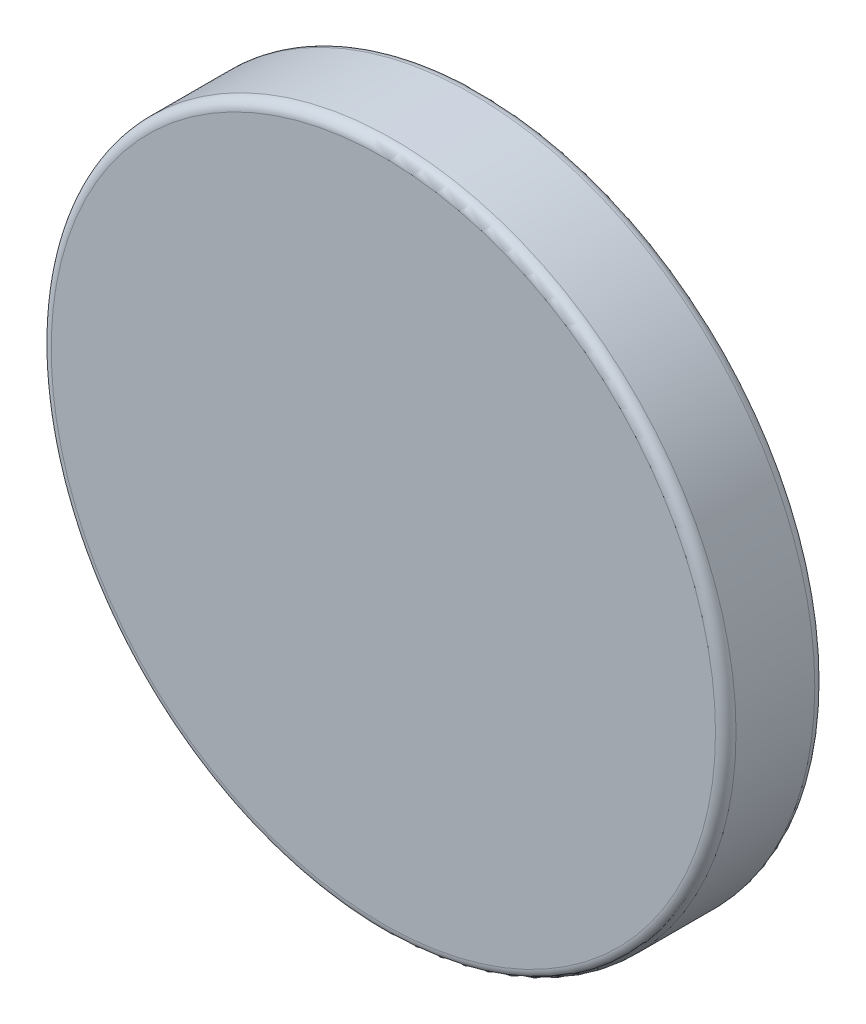
ISO-10303-21;
HEADER;
FILE_DESCRIPTION(('STEP AP214'),'2;1');
FILE_NAME('part.step','',(''),(''),'','','');
FILE_SCHEMA(('AUTOMOTIVE_DESIGN { 1 0 10303 214 1 1 1 1 }'));
ENDSEC;
DATA;
#1=APPLICATION_CONTEXT('core data for automotive mechanical design processes');
#2=APPLICATION_PROTOCOL_DEFINITION('international standard','automotive_design',2000,#1);
#3=PRODUCT_CONTEXT('',#1,'mechanical');
#4=PRODUCT('Part','Part','',(#3));
#5=PRODUCT_RELATED_PRODUCT_CATEGORY('part','',(#4));
#6=PRODUCT_DEFINITION_FORMATION('','',#4);
#7=PRODUCT_DEFINITION_CONTEXT('part definition',#1,'design');
#8=PRODUCT_DEFINITION('design','',#6,#7);
#9=PRODUCT_DEFINITION_SHAPE('','',#8);
#10=(LENGTH_UNIT() NAMED_UNIT(*) SI_UNIT(.MILLI.,.METRE.));
#11=(NAMED_UNIT(*) PLANE_ANGLE_UNIT() SI_UNIT($,.RADIAN.));
#12=(NAMED_UNIT(*) SI_UNIT($,.STERADIAN.) SOLID_ANGLE_UNIT());
#13=UNCERTAINTY_MEASURE_WITH_UNIT(LENGTH_MEASURE(1.E-05),#10,'distance_accuracy_value','');
#14=(GEOMETRIC_REPRESENTATION_CONTEXT(3) GLOBAL_UNCERTAINTY_ASSIGNED_CONTEXT((#13)) GLOBAL_UNIT_ASSIGNED_CONTEXT((#10,
#11,#12)) REPRESENTATION_CONTEXT('',''));
#15=CARTESIAN_POINT('',(0.,0.,0.));
#16=DIRECTION('',(0.,0.,1.));
#17=DIRECTION('',(1.,0.,0.));
#18=AXIS2_PLACEMENT_3D('',#15,#16,#17);
#19=CARTESIAN_POINT('',(0.,0.,1.45));
#20=DIRECTION('',(0.,0.,-1.));
#21=DIRECTION('',(-1.,0.,0.));
#22=AXIS2_PLACEMENT_3D('',#19,#20,#21);
#23=CYLINDRICAL_SURFACE('',#22,5.);
#24=CARTESIAN_POINT('',(0.,0.,0.15));
#25=DIRECTION('',(0.,0.,1.));
#26=DIRECTION('',(1.,0.,0.));
#27=AXIS2_PLACEMENT_3D('',#24,#25,#26);
#28=CIRCLE('',#27,5.);
#29=CARTESIAN_POINT('',(5.,0.,0.15));
#30=VERTEX_POINT('',#29);
#31=EDGE_CURVE('E42',#30,#30,#28,.T.);
#32=ORIENTED_EDGE('',*,*,#31,.T.);
#33=EDGE_LOOP('',(#32));
#34=FACE_BOUND('',#33,.T.);
#35=CARTESIAN_POINT('',(0.,0.,1.3));
#36=DIRECTION('',(0.,0.,1.));
#37=DIRECTION('',(1.,0.,0.));
#38=AXIS2_PLACEMENT_3D('',#35,#36,#37);
#39=CIRCLE('',#38,5.);
#40=CARTESIAN_POINT('',(5.,0.,1.3));
#41=VERTEX_POINT('',#40);
#42=EDGE_CURVE('E46',#41,#41,#39,.F.);
#43=ORIENTED_EDGE('',*,*,#42,.T.);
#44=EDGE_LOOP('',(#43));
#45=FACE_BOUND('',#44,.T.);
#46=ADVANCED_FACE('F31',(#34,#45),#23,.T.);
#47=CARTESIAN_POINT('',(0.,0.,1.45));
#48=DIRECTION('',(0.,0.,1.));
#49=DIRECTION('',(1.,0.,0.));
#50=AXIS2_PLACEMENT_3D('',#47,#48,#49);
#51=PLANE('',#50);
#52=CARTESIAN_POINT('',(0.,0.,1.45));
#53=DIRECTION('',(0.,0.,1.));
#54=DIRECTION('',(1.,0.,0.));
#55=AXIS2_PLACEMENT_3D('',#52,#53,#54);
#56=CIRCLE('',#55,4.85);
#57=CARTESIAN_POINT('',(4.85,0.,1.45));
#58=VERTEX_POINT('',#57);
#59=EDGE_CURVE('E10',#58,#58,#56,.T.);
#60=ORIENTED_EDGE('',*,*,#59,.T.);
#61=EDGE_LOOP('',(#60));
#62=FACE_BOUND('',#61,.T.);
#63=ADVANCED_FACE('F62',(#62),#51,.T.);
#64=CARTESIAN_POINT('',(0.,0.,0.));
#65=DIRECTION('',(0.,0.,1.));
#66=DIRECTION('',(1.,0.,0.));
#67=AXIS2_PLACEMENT_3D('',#64,#65,#66);
#68=PLANE('',#67);
#69=CARTESIAN_POINT('',(0.,0.,0.));
#70=DIRECTION('',(0.,0.,1.));
#71=DIRECTION('',(1.,0.,0.));
#72=AXIS2_PLACEMENT_3D('',#69,#70,#71);
#73=CIRCLE('',#72,4.85);
#74=CARTESIAN_POINT('',(4.85,0.,0.));
#75=VERTEX_POINT('',#74);
#76=EDGE_CURVE('E38',#75,#75,#73,.F.);
#77=ORIENTED_EDGE('',*,*,#76,.T.);
#78=EDGE_LOOP('',(#77));
#79=FACE_BOUND('',#78,.T.);
#80=ADVANCED_FACE('F59',(#79),#68,.F.);
#81=CARTESIAN_POINT('',(0.,0.,0.15));
#82=DIRECTION('',(0.,0.,1.));
#83=DIRECTION('',(1.,0.,0.));
#84=AXIS2_PLACEMENT_3D('',#81,#82,#83);
#85=TOROIDAL_SURFACE('',#84,4.85,0.15);
#86=ORIENTED_EDGE('',*,*,#76,.F.);
#87=EDGE_LOOP('',(#86));
#88=FACE_BOUND('',#87,.T.);
#89=ORIENTED_EDGE('',*,*,#31,.F.);
#90=EDGE_LOOP('',(#89));
#91=FACE_BOUND('',#90,.T.);
#92=ADVANCED_FACE('F55',(#88,#91),#85,.T.);
#93=CARTESIAN_POINT('',(0.,0.,1.3));
#94=DIRECTION('',(0.,0.,1.));
#95=DIRECTION('',(1.,0.,0.));
#96=AXIS2_PLACEMENT_3D('',#93,#94,#95);
#97=TOROIDAL_SURFACE('',#96,4.85,0.15);
#98=ORIENTED_EDGE('',*,*,#42,.F.);
#99=EDGE_LOOP('',(#98));
#100=FACE_BOUND('',#99,.T.);
#101=ORIENTED_EDGE('',*,*,#59,.F.);
#102=EDGE_LOOP('',(#101));
#103=FACE_BOUND('',#102,.T.);
#104=ADVANCED_FACE('F33',(#100,#103),#97,.T.);
#105=CLOSED_SHELL('',(#46,#63,#80,#92,#104));
#106=MANIFOLD_SOLID_BREP('B2',#105);
#107=ADVANCED_BREP_SHAPE_REPRESENTATION('',(#18,#106),#14);
#108=SHAPE_DEFINITION_REPRESENTATION(#9,#107);
ENDSEC;
END-ISO-10303-21;
